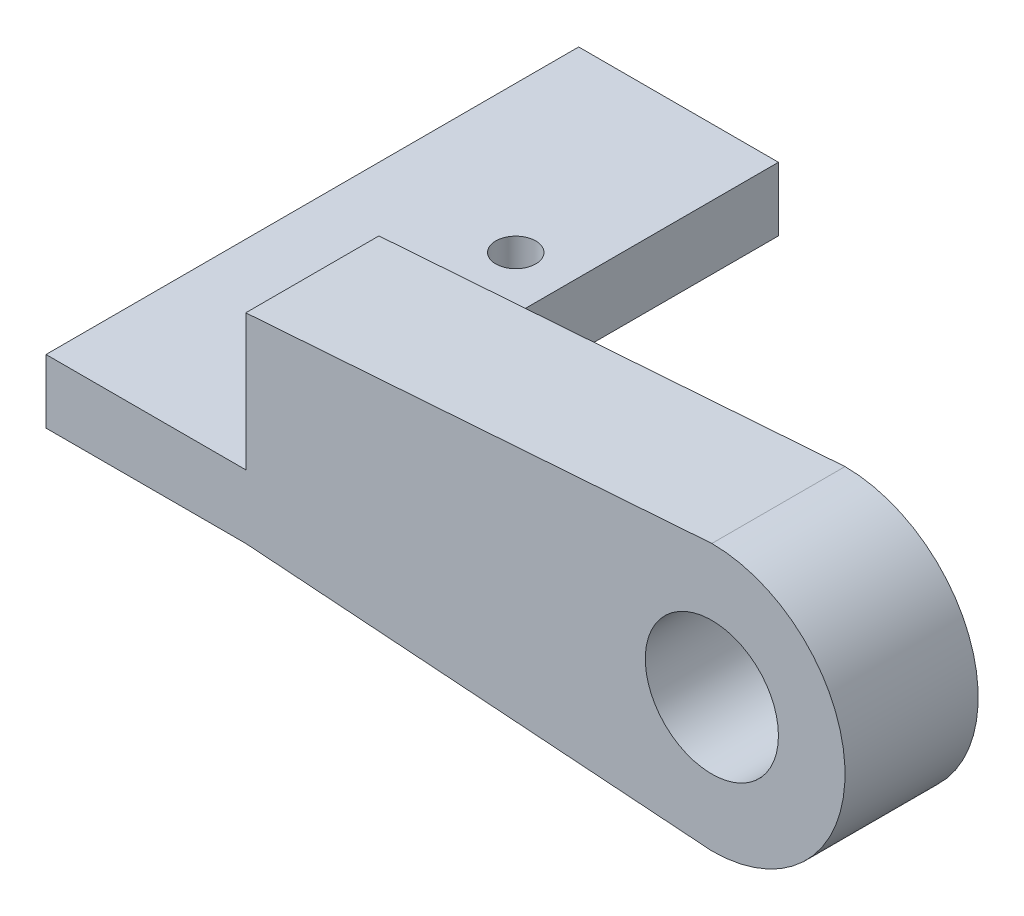
ISO-10303-21;
HEADER;
FILE_DESCRIPTION(('STEP AP214'),'2;1');
FILE_NAME('part.step','',(''),(''),'','','');
FILE_SCHEMA(('AUTOMOTIVE_DESIGN { 1 0 10303 214 1 1 1 1 }'));
ENDSEC;
DATA;
#1=APPLICATION_CONTEXT('core data for automotive mechanical design processes');
#2=APPLICATION_PROTOCOL_DEFINITION('international standard','automotive_design',2000,#1);
#3=PRODUCT_CONTEXT('',#1,'mechanical');
#4=PRODUCT('Part','Part','',(#3));
#5=PRODUCT_RELATED_PRODUCT_CATEGORY('part','',(#4));
#6=PRODUCT_DEFINITION_FORMATION('','',#4);
#7=PRODUCT_DEFINITION_CONTEXT('part definition',#1,'design');
#8=PRODUCT_DEFINITION('design','',#6,#7);
#9=PRODUCT_DEFINITION_SHAPE('','',#8);
#10=(LENGTH_UNIT() NAMED_UNIT(*) SI_UNIT(.MILLI.,.METRE.));
#11=(NAMED_UNIT(*) PLANE_ANGLE_UNIT() SI_UNIT($,.RADIAN.));
#12=(NAMED_UNIT(*) SI_UNIT($,.STERADIAN.) SOLID_ANGLE_UNIT());
#13=UNCERTAINTY_MEASURE_WITH_UNIT(LENGTH_MEASURE(1.E-05),#10,'distance_accuracy_value','');
#14=(GEOMETRIC_REPRESENTATION_CONTEXT(3) GLOBAL_UNCERTAINTY_ASSIGNED_CONTEXT((#13)) GLOBAL_UNIT_ASSIGNED_CONTEXT((#10,
#11,#12)) REPRESENTATION_CONTEXT('',''));
#15=CARTESIAN_POINT('',(0.,0.,0.));
#16=DIRECTION('',(0.,0.,1.));
#17=DIRECTION('',(1.,0.,0.));
#18=AXIS2_PLACEMENT_3D('',#15,#16,#17);
#19=CARTESIAN_POINT('',(0.,0.,0.));
#20=DIRECTION('',(0.,0.,1.));
#21=DIRECTION('',(1.,0.,0.));
#22=AXIS2_PLACEMENT_3D('',#19,#20,#21);
#23=PLANE('',#22);
#24=CARTESIAN_POINT('',(0.,0.,0.));
#25=DIRECTION('',(0.,0.,1.));
#26=DIRECTION('',(1.,0.,0.));
#27=AXIS2_PLACEMENT_3D('',#24,#25,#26);
#28=CIRCLE('',#27,5.);
#29=CARTESIAN_POINT('',(5.,0.,0.));
#30=VERTEX_POINT('',#29);
#31=EDGE_CURVE('E160',#30,#30,#28,.T.);
#32=ORIENTED_EDGE('',*,*,#31,.T.);
#33=EDGE_LOOP('',(#32));
#34=FACE_BOUND('',#33,.T.);
#35=DIRECTION('',(0.,-1.,0.));
#36=VECTOR('',#35,1.);
#37=CARTESIAN_POINT('',(-35.,-2.71095214888106,0.));
#38=LINE('',#37,#36);
#39=CARTESIAN_POINT('',(-35.,-2.71095214888106,0.));
#40=VERTEX_POINT('',#39);
#41=CARTESIAN_POINT('',(-35.,-7.5,0.));
#42=VERTEX_POINT('',#41);
#43=EDGE_CURVE('E141',#40,#42,#38,.T.);
#44=ORIENTED_EDGE('',*,*,#43,.F.);
#45=DIRECTION('',(0.,-1.,0.));
#46=VECTOR('',#45,1.);
#47=CARTESIAN_POINT('',(-35.,7.5,0.));
#48=LINE('',#47,#46);
#49=CARTESIAN_POINT('',(-35.,7.5,0.));
#50=VERTEX_POINT('',#49);
#51=EDGE_CURVE('E178',#50,#40,#48,.T.);
#52=ORIENTED_EDGE('',*,*,#51,.F.);
#53=DIRECTION('',(-0.997458699830735,-0.0712470499879096,0.));
#54=VECTOR('',#53,1.);
#55=CARTESIAN_POINT('',(0.,10.,0.));
#56=LINE('',#55,#54);
#57=CARTESIAN_POINT('',(0.,10.,0.));
#58=VERTEX_POINT('',#57);
#59=EDGE_CURVE('E176',#58,#50,#56,.T.);
#60=ORIENTED_EDGE('',*,*,#59,.F.);
#61=CARTESIAN_POINT('',(0.,0.,0.));
#62=DIRECTION('',(0.,0.,1.));
#63=DIRECTION('',(1.,0.,0.));
#64=AXIS2_PLACEMENT_3D('',#61,#62,#63);
#65=CIRCLE('',#64,10.);
#66=CARTESIAN_POINT('',(0.,-10.,0.));
#67=VERTEX_POINT('',#66);
#68=EDGE_CURVE('E164',#67,#58,#65,.T.);
#69=ORIENTED_EDGE('',*,*,#68,.F.);
#70=DIRECTION('',(0.997458699830735,-0.0712470499879096,0.));
#71=VECTOR('',#70,1.);
#72=CARTESIAN_POINT('',(-35.,-7.5,0.));
#73=LINE('',#72,#71);
#74=EDGE_CURVE('E86',#42,#67,#73,.T.);
#75=ORIENTED_EDGE('',*,*,#74,.F.);
#76=EDGE_LOOP('',(#44,#52,#60,#69,#75));
#77=FACE_BOUND('',#76,.T.);
#78=ADVANCED_FACE('F44',(#34,#77),#23,.F.);
#79=CARTESIAN_POINT('',(-35.,7.5,10.));
#80=DIRECTION('',(1.,0.,0.));
#81=DIRECTION('',(0.,0.,-1.));
#82=AXIS2_PLACEMENT_3D('',#79,#80,#81);
#83=PLANE('',#82);
#84=DIRECTION('',(0.,0.,-1.));
#85=VECTOR('',#84,1.);
#86=CARTESIAN_POINT('',(-35.,-2.71095214888106,0.));
#87=LINE('',#86,#85);
#88=CARTESIAN_POINT('',(-35.,-2.71095214888106,10.));
#89=VERTEX_POINT('',#88);
#90=EDGE_CURVE('E59',#89,#40,#87,.T.);
#91=ORIENTED_EDGE('',*,*,#90,.F.);
#92=DIRECTION('',(0.,-1.,0.));
#93=VECTOR('',#92,1.);
#94=CARTESIAN_POINT('',(-35.,7.5,10.));
#95=LINE('',#94,#93);
#96=CARTESIAN_POINT('',(-35.,7.5,10.));
#97=VERTEX_POINT('',#96);
#98=EDGE_CURVE('E170',#97,#89,#95,.T.);
#99=ORIENTED_EDGE('',*,*,#98,.F.);
#100=DIRECTION('',(0.,0.,-1.));
#101=VECTOR('',#100,1.);
#102=CARTESIAN_POINT('',(-35.,7.5,10.));
#103=LINE('',#102,#101);
#104=EDGE_CURVE('E52',#97,#50,#103,.T.);
#105=ORIENTED_EDGE('',*,*,#104,.T.);
#106=ORIENTED_EDGE('',*,*,#51,.T.);
#107=EDGE_LOOP('',(#91,#99,#105,#106));
#108=FACE_BOUND('',#107,.T.);
#109=ADVANCED_FACE('F185',(#108),#83,.F.);
#110=CARTESIAN_POINT('',(0.,0.,10.));
#111=DIRECTION('',(0.,0.,1.));
#112=DIRECTION('',(1.,0.,0.));
#113=AXIS2_PLACEMENT_3D('',#110,#111,#112);
#114=PLANE('',#113);
#115=CARTESIAN_POINT('',(0.,0.,10.));
#116=DIRECTION('',(0.,0.,1.));
#117=DIRECTION('',(1.,0.,0.));
#118=AXIS2_PLACEMENT_3D('',#115,#116,#117);
#119=CIRCLE('',#118,10.);
#120=CARTESIAN_POINT('',(0.,-10.,10.));
#121=VERTEX_POINT('',#120);
#122=CARTESIAN_POINT('',(0.,10.,10.));
#123=VERTEX_POINT('',#122);
#124=EDGE_CURVE('E167',#121,#123,#119,.T.);
#125=ORIENTED_EDGE('',*,*,#124,.T.);
#126=DIRECTION('',(-0.997458699830735,-0.0712470499879096,0.));
#127=VECTOR('',#126,1.);
#128=CARTESIAN_POINT('',(0.,10.,10.));
#129=LINE('',#128,#127);
#130=EDGE_CURVE('E93',#123,#97,#129,.T.);
#131=ORIENTED_EDGE('',*,*,#130,.T.);
#132=ORIENTED_EDGE('',*,*,#98,.T.);
#133=DIRECTION('',(1.,0.,0.));
#134=VECTOR('',#133,1.);
#135=CARTESIAN_POINT('',(-50.,-2.71095214888106,10.));
#136=LINE('',#135,#134);
#137=CARTESIAN_POINT('',(-50.,-2.71095214888106,10.));
#138=VERTEX_POINT('',#137);
#139=EDGE_CURVE('E154',#138,#89,#136,.T.);
#140=ORIENTED_EDGE('',*,*,#139,.F.);
#141=DIRECTION('',(0.,1.,0.));
#142=VECTOR('',#141,1.);
#143=CARTESIAN_POINT('',(-50.,-2.71095214888106,10.));
#144=LINE('',#143,#142);
#145=CARTESIAN_POINT('',(-50.,-7.5,10.));
#146=VERTEX_POINT('',#145);
#147=EDGE_CURVE('E151',#146,#138,#144,.T.);
#148=ORIENTED_EDGE('',*,*,#147,.F.);
#149=DIRECTION('',(1.,0.,0.));
#150=VECTOR('',#149,1.);
#151=CARTESIAN_POINT('',(-50.,-7.5,10.));
#152=LINE('',#151,#150);
#153=CARTESIAN_POINT('',(-35.,-7.5,10.));
#154=VERTEX_POINT('',#153);
#155=EDGE_CURVE('E158',#146,#154,#152,.T.);
#156=ORIENTED_EDGE('',*,*,#155,.T.);
#157=DIRECTION('',(0.997458699830735,-0.0712470499879096,0.));
#158=VECTOR('',#157,1.);
#159=CARTESIAN_POINT('',(-35.,-7.5,10.));
#160=LINE('',#159,#158);
#161=EDGE_CURVE('E68',#154,#121,#160,.T.);
#162=ORIENTED_EDGE('',*,*,#161,.T.);
#163=EDGE_LOOP('',(#125,#131,#132,#140,#148,#156,#162));
#164=FACE_BOUND('',#163,.T.);
#165=CARTESIAN_POINT('',(0.,0.,10.));
#166=DIRECTION('',(0.,0.,1.));
#167=DIRECTION('',(1.,0.,0.));
#168=AXIS2_PLACEMENT_3D('',#165,#166,#167);
#169=CIRCLE('',#168,5.);
#170=CARTESIAN_POINT('',(5.,0.,10.));
#171=VERTEX_POINT('',#170);
#172=EDGE_CURVE('E161',#171,#171,#169,.T.);
#173=ORIENTED_EDGE('',*,*,#172,.F.);
#174=EDGE_LOOP('',(#173));
#175=FACE_BOUND('',#174,.T.);
#176=ADVANCED_FACE('F217',(#164,#175),#114,.T.);
#177=CARTESIAN_POINT('',(0.,0.,10.));
#178=DIRECTION('',(0.,0.,-1.));
#179=DIRECTION('',(-1.,0.,0.));
#180=AXIS2_PLACEMENT_3D('',#177,#178,#179);
#181=CYLINDRICAL_SURFACE('',#180,10.);
#182=ORIENTED_EDGE('',*,*,#68,.T.);
#183=DIRECTION('',(0.,0.,-1.));
#184=VECTOR('',#183,1.);
#185=CARTESIAN_POINT('',(0.,10.,10.));
#186=LINE('',#185,#184);
#187=EDGE_CURVE('E13',#123,#58,#186,.T.);
#188=ORIENTED_EDGE('',*,*,#187,.F.);
#189=ORIENTED_EDGE('',*,*,#124,.F.);
#190=DIRECTION('',(0.,0.,-1.));
#191=VECTOR('',#190,1.);
#192=CARTESIAN_POINT('',(0.,-10.,10.));
#193=LINE('',#192,#191);
#194=EDGE_CURVE('E173',#121,#67,#193,.T.);
#195=ORIENTED_EDGE('',*,*,#194,.T.);
#196=EDGE_LOOP('',(#182,#188,#189,#195));
#197=FACE_BOUND('',#196,.T.);
#198=ADVANCED_FACE('F46',(#197),#181,.T.);
#199=CARTESIAN_POINT('',(0.,10.,10.));
#200=DIRECTION('',(0.0712470499879096,-0.997458699830735,0.));
#201=DIRECTION('',(0.997458699830735,0.0712470499879096,0.));
#202=AXIS2_PLACEMENT_3D('',#199,#200,#201);
#203=PLANE('',#202);
#204=ORIENTED_EDGE('',*,*,#59,.T.);
#205=ORIENTED_EDGE('',*,*,#104,.F.);
#206=ORIENTED_EDGE('',*,*,#130,.F.);
#207=ORIENTED_EDGE('',*,*,#187,.T.);
#208=EDGE_LOOP('',(#204,#205,#206,#207));
#209=FACE_BOUND('',#208,.T.);
#210=ADVANCED_FACE('F222',(#209),#203,.F.);
#211=CARTESIAN_POINT('',(-35.,-7.5,10.));
#212=DIRECTION('',(0.0712470499879096,0.997458699830735,0.));
#213=DIRECTION('',(-0.997458699830735,0.0712470499879096,0.));
#214=AXIS2_PLACEMENT_3D('',#211,#212,#213);
#215=PLANE('',#214);
#216=ORIENTED_EDGE('',*,*,#74,.T.);
#217=ORIENTED_EDGE('',*,*,#194,.F.);
#218=ORIENTED_EDGE('',*,*,#161,.F.);
#219=DIRECTION('',(0.,0.,-1.));
#220=VECTOR('',#219,1.);
#221=CARTESIAN_POINT('',(-35.,-7.5,10.));
#222=LINE('',#221,#220);
#223=EDGE_CURVE('E182',#154,#42,#222,.T.);
#224=ORIENTED_EDGE('',*,*,#223,.T.);
#225=EDGE_LOOP('',(#216,#217,#218,#224));
#226=FACE_BOUND('',#225,.T.);
#227=ADVANCED_FACE('F224',(#226),#215,.F.);
#228=CARTESIAN_POINT('',(0.,0.,10.));
#229=DIRECTION('',(0.,0.,-1.));
#230=DIRECTION('',(-1.,0.,0.));
#231=AXIS2_PLACEMENT_3D('',#228,#229,#230);
#232=CYLINDRICAL_SURFACE('',#231,5.);
#233=ORIENTED_EDGE('',*,*,#172,.T.);
#234=EDGE_LOOP('',(#233));
#235=FACE_BOUND('',#234,.T.);
#236=ORIENTED_EDGE('',*,*,#31,.F.);
#237=EDGE_LOOP('',(#236));
#238=FACE_BOUND('',#237,.T.);
#239=ADVANCED_FACE('F229',(#235,#238),#232,.F.);
#240=CARTESIAN_POINT('',(-50.,-7.5,0.));
#241=DIRECTION('',(0.,1.,0.));
#242=DIRECTION('',(0.,0.,1.));
#243=AXIS2_PLACEMENT_3D('',#240,#241,#242);
#244=PLANE('',#243);
#245=CARTESIAN_POINT('',(-39.,-7.5,-2.27346103709026));
#246=DIRECTION('',(0.,1.,0.));
#247=DIRECTION('',(0.,0.,1.));
#248=AXIS2_PLACEMENT_3D('',#245,#246,#247);
#249=CIRCLE('',#248,1.5);
#250=CARTESIAN_POINT('',(-39.,-7.5,-0.773461037090267));
#251=VERTEX_POINT('',#250);
#252=EDGE_CURVE('E188',#251,#251,#249,.F.);
#253=ORIENTED_EDGE('',*,*,#252,.F.);
#254=EDGE_LOOP('',(#253));
#255=FACE_BOUND('',#254,.T.);
#256=CARTESIAN_POINT('',(-39.,-7.5,-14.2734610370903));
#257=DIRECTION('',(0.,1.,0.));
#258=DIRECTION('',(0.,0.,1.));
#259=AXIS2_PLACEMENT_3D('',#256,#257,#258);
#260=CIRCLE('',#259,1.5);
#261=CARTESIAN_POINT('',(-39.,-7.5,-12.7734610370903));
#262=VERTEX_POINT('',#261);
#263=EDGE_CURVE('E195',#262,#262,#260,.F.);
#264=ORIENTED_EDGE('',*,*,#263,.F.);
#265=EDGE_LOOP('',(#264));
#266=FACE_BOUND('',#265,.T.);
#267=ORIENTED_EDGE('',*,*,#223,.F.);
#268=ORIENTED_EDGE('',*,*,#155,.F.);
#269=DIRECTION('',(0.,0.,1.));
#270=VECTOR('',#269,1.);
#271=CARTESIAN_POINT('',(-50.,-7.5,0.));
#272=LINE('',#271,#270);
#273=CARTESIAN_POINT('',(-50.,-7.5,-30.));
#274=VERTEX_POINT('',#273);
#275=EDGE_CURVE('E127',#274,#146,#272,.T.);
#276=ORIENTED_EDGE('',*,*,#275,.F.);
#277=DIRECTION('',(-1.,0.,0.));
#278=VECTOR('',#277,1.);
#279=CARTESIAN_POINT('',(-35.,-7.5,-30.));
#280=LINE('',#279,#278);
#281=CARTESIAN_POINT('',(-35.,-7.5,-30.));
#282=VERTEX_POINT('',#281);
#283=EDGE_CURVE('E119',#282,#274,#280,.T.);
#284=ORIENTED_EDGE('',*,*,#283,.F.);
#285=DIRECTION('',(0.,0.,1.));
#286=VECTOR('',#285,1.);
#287=CARTESIAN_POINT('',(-35.,-7.5,-30.));
#288=LINE('',#287,#286);
#289=EDGE_CURVE('E124',#282,#42,#288,.T.);
#290=ORIENTED_EDGE('',*,*,#289,.T.);
#291=EDGE_LOOP('',(#267,#268,#276,#284,#290));
#292=FACE_BOUND('',#291,.T.);
#293=ADVANCED_FACE('F122',(#255,#266,#292),#244,.F.);
#294=CARTESIAN_POINT('',(-50.,-2.71095214888106,0.));
#295=DIRECTION('',(0.,-1.,0.));
#296=DIRECTION('',(0.,0.,-1.));
#297=AXIS2_PLACEMENT_3D('',#294,#295,#296);
#298=PLANE('',#297);
#299=CARTESIAN_POINT('',(-39.,-2.71095214888106,-2.27346103709026));
#300=DIRECTION('',(0.,1.,0.));
#301=DIRECTION('',(0.,0.,1.));
#302=AXIS2_PLACEMENT_3D('',#299,#300,#301);
#303=CIRCLE('',#302,1.5);
#304=CARTESIAN_POINT('',(-39.,-2.71095214888106,-0.773461037090267));
#305=VERTEX_POINT('',#304);
#306=EDGE_CURVE('E190',#305,#305,#303,.T.);
#307=ORIENTED_EDGE('',*,*,#306,.F.);
#308=EDGE_LOOP('',(#307));
#309=FACE_BOUND('',#308,.T.);
#310=CARTESIAN_POINT('',(-39.,-2.71095214888106,-14.2734610370903));
#311=DIRECTION('',(0.,1.,0.));
#312=DIRECTION('',(0.,0.,1.));
#313=AXIS2_PLACEMENT_3D('',#310,#311,#312);
#314=CIRCLE('',#313,1.5);
#315=CARTESIAN_POINT('',(-39.,-2.71095214888106,-12.7734610370903));
#316=VERTEX_POINT('',#315);
#317=EDGE_CURVE('E198',#316,#316,#314,.T.);
#318=ORIENTED_EDGE('',*,*,#317,.F.);
#319=EDGE_LOOP('',(#318));
#320=FACE_BOUND('',#319,.T.);
#321=ORIENTED_EDGE('',*,*,#90,.T.);
#322=DIRECTION('',(0.,0.,1.));
#323=VECTOR('',#322,1.);
#324=CARTESIAN_POINT('',(-35.,-2.71095214888106,-30.));
#325=LINE('',#324,#323);
#326=CARTESIAN_POINT('',(-35.,-2.71095214888106,-30.));
#327=VERTEX_POINT('',#326);
#328=EDGE_CURVE('E144',#327,#40,#325,.T.);
#329=ORIENTED_EDGE('',*,*,#328,.F.);
#330=DIRECTION('',(1.,0.,0.));
#331=VECTOR('',#330,1.);
#332=CARTESIAN_POINT('',(-35.,-2.71095214888106,-30.));
#333=LINE('',#332,#331);
#334=CARTESIAN_POINT('',(-50.,-2.71095214888106,-30.));
#335=VERTEX_POINT('',#334);
#336=EDGE_CURVE('E137',#335,#327,#333,.T.);
#337=ORIENTED_EDGE('',*,*,#336,.F.);
#338=DIRECTION('',(0.,0.,-1.));
#339=VECTOR('',#338,1.);
#340=CARTESIAN_POINT('',(-50.,-2.71095214888106,0.));
#341=LINE('',#340,#339);
#342=EDGE_CURVE('E153',#138,#335,#341,.T.);
#343=ORIENTED_EDGE('',*,*,#342,.F.);
#344=ORIENTED_EDGE('',*,*,#139,.T.);
#345=EDGE_LOOP('',(#321,#329,#337,#343,#344));
#346=FACE_BOUND('',#345,.T.);
#347=ADVANCED_FACE('F207',(#309,#320,#346),#298,.F.);
#348=CARTESIAN_POINT('',(-50.,0.,0.));
#349=DIRECTION('',(-1.,0.,0.));
#350=DIRECTION('',(0.,0.,1.));
#351=AXIS2_PLACEMENT_3D('',#348,#349,#350);
#352=PLANE('',#351);
#353=ORIENTED_EDGE('',*,*,#342,.T.);
#354=DIRECTION('',(0.,1.,0.));
#355=VECTOR('',#354,1.);
#356=CARTESIAN_POINT('',(-50.,-2.71095214888106,-30.));
#357=LINE('',#356,#355);
#358=EDGE_CURVE('E131',#274,#335,#357,.T.);
#359=ORIENTED_EDGE('',*,*,#358,.F.);
#360=ORIENTED_EDGE('',*,*,#275,.T.);
#361=ORIENTED_EDGE('',*,*,#147,.T.);
#362=EDGE_LOOP('',(#353,#359,#360,#361));
#363=FACE_BOUND('',#362,.T.);
#364=ADVANCED_FACE('F210',(#363),#352,.T.);
#365=CARTESIAN_POINT('',(-35.,-2.71095214888106,-30.));
#366=DIRECTION('',(-1.,0.,0.));
#367=DIRECTION('',(0.,0.,1.));
#368=AXIS2_PLACEMENT_3D('',#365,#366,#367);
#369=PLANE('',#368);
#370=ORIENTED_EDGE('',*,*,#43,.T.);
#371=ORIENTED_EDGE('',*,*,#289,.F.);
#372=DIRECTION('',(0.,-1.,0.));
#373=VECTOR('',#372,1.);
#374=CARTESIAN_POINT('',(-35.,-2.71095214888106,-30.));
#375=LINE('',#374,#373);
#376=EDGE_CURVE('E132',#327,#282,#375,.T.);
#377=ORIENTED_EDGE('',*,*,#376,.F.);
#378=ORIENTED_EDGE('',*,*,#328,.T.);
#379=EDGE_LOOP('',(#370,#371,#377,#378));
#380=FACE_BOUND('',#379,.T.);
#381=ADVANCED_FACE('F143',(#380),#369,.F.);
#382=CARTESIAN_POINT('',(0.,0.,-30.));
#383=DIRECTION('',(0.,0.,-1.));
#384=DIRECTION('',(-1.,0.,0.));
#385=AXIS2_PLACEMENT_3D('',#382,#383,#384);
#386=PLANE('',#385);
#387=ORIENTED_EDGE('',*,*,#376,.T.);
#388=ORIENTED_EDGE('',*,*,#283,.T.);
#389=ORIENTED_EDGE('',*,*,#358,.T.);
#390=ORIENTED_EDGE('',*,*,#336,.T.);
#391=EDGE_LOOP('',(#387,#388,#389,#390));
#392=FACE_BOUND('',#391,.T.);
#393=ADVANCED_FACE('F135',(#392),#386,.T.);
#394=CARTESIAN_POINT('',(-39.,-10.001,-14.2734610370903));
#395=DIRECTION('',(0.,1.,0.));
#396=DIRECTION('',(0.,0.,1.));
#397=AXIS2_PLACEMENT_3D('',#394,#395,#396);
#398=CYLINDRICAL_SURFACE('',#397,1.5);
#399=ORIENTED_EDGE('',*,*,#317,.T.);
#400=EDGE_LOOP('',(#399));
#401=FACE_BOUND('',#400,.T.);
#402=ORIENTED_EDGE('',*,*,#263,.T.);
#403=EDGE_LOOP('',(#402));
#404=FACE_BOUND('',#403,.T.);
#405=ADVANCED_FACE('F254',(#401,#404),#398,.F.);
#406=CARTESIAN_POINT('',(-39.,-10.001,-2.27346103709026));
#407=DIRECTION('',(0.,1.,0.));
#408=DIRECTION('',(0.,0.,1.));
#409=AXIS2_PLACEMENT_3D('',#406,#407,#408);
#410=CYLINDRICAL_SURFACE('',#409,1.5);
#411=ORIENTED_EDGE('',*,*,#306,.T.);
#412=EDGE_LOOP('',(#411));
#413=FACE_BOUND('',#412,.T.);
#414=ORIENTED_EDGE('',*,*,#252,.T.);
#415=EDGE_LOOP('',(#414));
#416=FACE_BOUND('',#415,.T.);
#417=ADVANCED_FACE('F204',(#413,#416),#410,.F.);
#418=CLOSED_SHELL('',(#78,#109,#176,#198,#210,#227,#239,#293,#347,#364,#381,#393,#405,#417));
#419=MANIFOLD_SOLID_BREP('B2',#418);
#420=ADVANCED_BREP_SHAPE_REPRESENTATION('',(#18,#419),#14);
#421=SHAPE_DEFINITION_REPRESENTATION(#9,#420);
ENDSEC;
END-ISO-10303-21;
